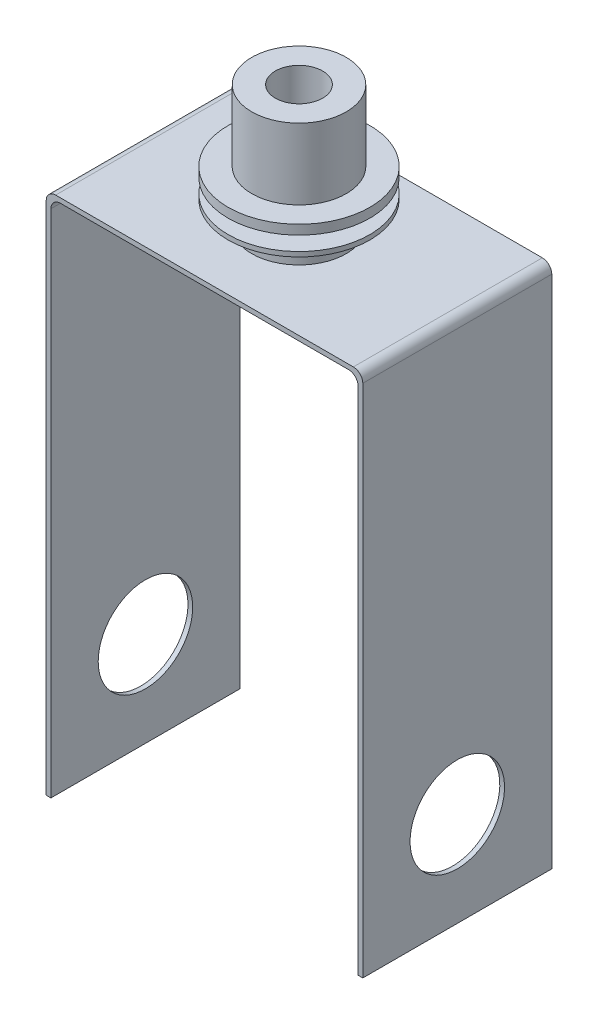
ISO-10303-21;
HEADER;
FILE_DESCRIPTION(('STEP AP214'),'2;1');
FILE_NAME('part.step','',(''),(''),'','','');
FILE_SCHEMA(('AUTOMOTIVE_DESIGN { 1 0 10303 214 1 1 1 1 }'));
ENDSEC;
DATA;
#1=APPLICATION_CONTEXT('core data for automotive mechanical design processes');
#2=APPLICATION_PROTOCOL_DEFINITION('international standard','automotive_design',2000,#1);
#3=PRODUCT_CONTEXT('',#1,'mechanical');
#4=PRODUCT('Part','Part','',(#3));
#5=PRODUCT_RELATED_PRODUCT_CATEGORY('part','',(#4));
#6=PRODUCT_DEFINITION_FORMATION('','',#4);
#7=PRODUCT_DEFINITION_CONTEXT('part definition',#1,'design');
#8=PRODUCT_DEFINITION('design','',#6,#7);
#9=PRODUCT_DEFINITION_SHAPE('','',#8);
#10=(LENGTH_UNIT() NAMED_UNIT(*) SI_UNIT(.MILLI.,.METRE.));
#11=(NAMED_UNIT(*) PLANE_ANGLE_UNIT() SI_UNIT($,.RADIAN.));
#12=(NAMED_UNIT(*) SI_UNIT($,.STERADIAN.) SOLID_ANGLE_UNIT());
#13=UNCERTAINTY_MEASURE_WITH_UNIT(LENGTH_MEASURE(1.E-05),#10,'distance_accuracy_value','');
#14=(GEOMETRIC_REPRESENTATION_CONTEXT(3) GLOBAL_UNCERTAINTY_ASSIGNED_CONTEXT((#13)) GLOBAL_UNIT_ASSIGNED_CONTEXT((#10,
#11,#12)) REPRESENTATION_CONTEXT('',''));
#15=CARTESIAN_POINT('',(0.,0.,0.));
#16=DIRECTION('',(0.,0.,1.));
#17=DIRECTION('',(1.,0.,0.));
#18=AXIS2_PLACEMENT_3D('',#15,#16,#17);
#19=CARTESIAN_POINT('',(0.,148.59,25.4));
#20=DIRECTION('',(0.,-1.,0.));
#21=DIRECTION('',(0.,0.,-1.));
#22=AXIS2_PLACEMENT_3D('',#19,#20,#21);
#23=CYLINDRICAL_SURFACE('',#22,12.7);
#24=CARTESIAN_POINT('',(0.,123.19,25.4));
#25=DIRECTION('',(0.,1.,0.));
#26=DIRECTION('',(0.,0.,1.));
#27=AXIS2_PLACEMENT_3D('',#24,#25,#26);
#28=CIRCLE('',#27,12.7);
#29=CARTESIAN_POINT('',(0.,123.19,38.1));
#30=VERTEX_POINT('',#29);
#31=EDGE_CURVE('E53',#30,#30,#28,.T.);
#32=ORIENTED_EDGE('',*,*,#31,.T.);
#33=EDGE_LOOP('',(#32));
#34=FACE_BOUND('',#33,.T.);
#35=CARTESIAN_POINT('',(0.,127.,25.4));
#36=DIRECTION('',(0.,1.,0.));
#37=DIRECTION('',(0.,0.,1.));
#38=AXIS2_PLACEMENT_3D('',#35,#36,#37);
#39=CIRCLE('',#38,12.7);
#40=CARTESIAN_POINT('',(0.,127.,38.1));
#41=VERTEX_POINT('',#40);
#42=EDGE_CURVE('E11',#41,#41,#39,.T.);
#43=ORIENTED_EDGE('',*,*,#42,.F.);
#44=EDGE_LOOP('',(#43));
#45=FACE_BOUND('',#44,.T.);
#46=ADVANCED_FACE('F43',(#34,#45),#23,.T.);
#47=CARTESIAN_POINT('',(-40.005,113.03,50.8));
#48=DIRECTION('',(0.,0.,-1.));
#49=DIRECTION('',(-1.,0.,0.));
#50=AXIS2_PLACEMENT_3D('',#47,#48,#49);
#51=CYLINDRICAL_SURFACE('',#50,2.54);
#52=CARTESIAN_POINT('',(-40.005,113.03,0.));
#53=DIRECTION('',(0.,0.,-1.));
#54=DIRECTION('',(-1.,0.,0.));
#55=AXIS2_PLACEMENT_3D('',#52,#53,#54);
#56=CIRCLE('',#55,2.54);
#57=CARTESIAN_POINT('',(-42.545,113.03,0.));
#58=VERTEX_POINT('',#57);
#59=CARTESIAN_POINT('',(-40.005,115.57,0.));
#60=VERTEX_POINT('',#59);
#61=EDGE_CURVE('E174',#58,#60,#56,.T.);
#62=ORIENTED_EDGE('',*,*,#61,.F.);
#63=DIRECTION('',(0.,0.,-1.));
#64=VECTOR('',#63,1.);
#65=CARTESIAN_POINT('',(-42.545,113.03,50.8));
#66=LINE('',#65,#64);
#67=CARTESIAN_POINT('',(-42.545,113.03,50.8));
#68=VERTEX_POINT('',#67);
#69=EDGE_CURVE('E61',#68,#58,#66,.T.);
#70=ORIENTED_EDGE('',*,*,#69,.F.);
#71=CARTESIAN_POINT('',(-40.005,113.03,50.8));
#72=DIRECTION('',(0.,0.,-1.));
#73=DIRECTION('',(-1.,0.,0.));
#74=AXIS2_PLACEMENT_3D('',#71,#72,#73);
#75=CIRCLE('',#74,2.54);
#76=CARTESIAN_POINT('',(-40.005,115.57,50.8));
#77=VERTEX_POINT('',#76);
#78=EDGE_CURVE('E216',#68,#77,#75,.T.);
#79=ORIENTED_EDGE('',*,*,#78,.T.);
#80=DIRECTION('',(0.,0.,-1.));
#81=VECTOR('',#80,1.);
#82=CARTESIAN_POINT('',(-40.005,115.57,50.8));
#83=LINE('',#82,#81);
#84=EDGE_CURVE('E111',#77,#60,#83,.T.);
#85=ORIENTED_EDGE('',*,*,#84,.T.);
#86=EDGE_LOOP('',(#62,#70,#79,#85));
#87=FACE_BOUND('',#86,.T.);
#88=ADVANCED_FACE('F45',(#87),#51,.T.);
#89=CARTESIAN_POINT('',(-42.545,113.03,50.8));
#90=DIRECTION('',(1.,0.,0.));
#91=DIRECTION('',(0.,0.,-1.));
#92=AXIS2_PLACEMENT_3D('',#89,#90,#91);
#93=PLANE('',#92);
#94=CARTESIAN_POINT('',(-42.545,0.,25.4));
#95=DIRECTION('',(-1.,0.,0.));
#96=DIRECTION('',(0.,0.,1.));
#97=AXIS2_PLACEMENT_3D('',#94,#95,#96);
#98=CIRCLE('',#97,12.7);
#99=CARTESIAN_POINT('',(-42.545,0.,38.1));
#100=VERTEX_POINT('',#99);
#101=EDGE_CURVE('E293',#100,#100,#98,.T.);
#102=ORIENTED_EDGE('',*,*,#101,.F.);
#103=EDGE_LOOP('',(#102));
#104=FACE_BOUND('',#103,.T.);
#105=DIRECTION('',(0.,-1.,0.));
#106=VECTOR('',#105,1.);
#107=CARTESIAN_POINT('',(-42.545,113.03,0.));
#108=LINE('',#107,#106);
#109=CARTESIAN_POINT('',(-42.545,-25.4,0.));
#110=VERTEX_POINT('',#109);
#111=EDGE_CURVE('E102',#58,#110,#108,.T.);
#112=ORIENTED_EDGE('',*,*,#111,.T.);
#113=DIRECTION('',(0.,0.,-1.));
#114=VECTOR('',#113,1.);
#115=CARTESIAN_POINT('',(-42.545,-25.4,50.8));
#116=LINE('',#115,#114);
#117=CARTESIAN_POINT('',(-42.545,-25.4,50.8));
#118=VERTEX_POINT('',#117);
#119=EDGE_CURVE('E159',#118,#110,#116,.T.);
#120=ORIENTED_EDGE('',*,*,#119,.F.);
#121=DIRECTION('',(0.,-1.,0.));
#122=VECTOR('',#121,1.);
#123=CARTESIAN_POINT('',(-42.545,113.03,50.8));
#124=LINE('',#123,#122);
#125=EDGE_CURVE('E146',#68,#118,#124,.T.);
#126=ORIENTED_EDGE('',*,*,#125,.F.);
#127=ORIENTED_EDGE('',*,*,#69,.T.);
#128=EDGE_LOOP('',(#112,#120,#126,#127));
#129=FACE_BOUND('',#128,.T.);
#130=ADVANCED_FACE('F369',(#104,#129),#93,.F.);
#131=CARTESIAN_POINT('',(-42.545,-25.4,50.8));
#132=DIRECTION('',(0.,1.,0.));
#133=DIRECTION('',(-1.,0.,0.));
#134=AXIS2_PLACEMENT_3D('',#131,#132,#133);
#135=PLANE('',#134);
#136=DIRECTION('',(1.,0.,0.));
#137=VECTOR('',#136,1.);
#138=CARTESIAN_POINT('',(-42.545,-25.4,0.));
#139=LINE('',#138,#137);
#140=CARTESIAN_POINT('',(-41.275,-25.4,0.));
#141=VERTEX_POINT('',#140);
#142=EDGE_CURVE('E154',#110,#141,#139,.T.);
#143=ORIENTED_EDGE('',*,*,#142,.T.);
#144=DIRECTION('',(0.,0.,-1.));
#145=VECTOR('',#144,1.);
#146=CARTESIAN_POINT('',(-41.275,-25.4,50.8));
#147=LINE('',#146,#145);
#148=CARTESIAN_POINT('',(-41.275,-25.4,50.8));
#149=VERTEX_POINT('',#148);
#150=EDGE_CURVE('E151',#149,#141,#147,.T.);
#151=ORIENTED_EDGE('',*,*,#150,.F.);
#152=DIRECTION('',(1.,0.,0.));
#153=VECTOR('',#152,1.);
#154=CARTESIAN_POINT('',(-42.545,-25.4,50.8));
#155=LINE('',#154,#153);
#156=EDGE_CURVE('E140',#118,#149,#155,.T.);
#157=ORIENTED_EDGE('',*,*,#156,.F.);
#158=ORIENTED_EDGE('',*,*,#119,.T.);
#159=EDGE_LOOP('',(#143,#151,#157,#158));
#160=FACE_BOUND('',#159,.T.);
#161=ADVANCED_FACE('F152',(#160),#135,.F.);
#162=CARTESIAN_POINT('',(-41.275,111.76,50.8));
#163=DIRECTION('',(1.,0.,0.));
#164=DIRECTION('',(0.,1.,0.));
#165=AXIS2_PLACEMENT_3D('',#162,#163,#164);
#166=PLANE('',#165);
#167=CARTESIAN_POINT('',(-41.275,0.,25.4));
#168=DIRECTION('',(1.,0.,0.));
#169=DIRECTION('',(0.,1.,0.));
#170=AXIS2_PLACEMENT_3D('',#167,#168,#169);
#171=CIRCLE('',#170,12.7);
#172=CARTESIAN_POINT('',(-41.275,12.7,25.4));
#173=VERTEX_POINT('',#172);
#174=EDGE_CURVE('E179',#173,#173,#171,.T.);
#175=ORIENTED_EDGE('',*,*,#174,.F.);
#176=EDGE_LOOP('',(#175));
#177=FACE_BOUND('',#176,.T.);
#178=DIRECTION('',(0.,-1.,0.));
#179=VECTOR('',#178,1.);
#180=CARTESIAN_POINT('',(-41.275,111.76,0.));
#181=LINE('',#180,#179);
#182=CARTESIAN_POINT('',(-41.275,111.76,0.));
#183=VERTEX_POINT('',#182);
#184=EDGE_CURVE('E209',#183,#141,#181,.T.);
#185=ORIENTED_EDGE('',*,*,#184,.F.);
#186=DIRECTION('',(0.,0.,-1.));
#187=VECTOR('',#186,1.);
#188=CARTESIAN_POINT('',(-41.275,111.76,50.8));
#189=LINE('',#188,#187);
#190=CARTESIAN_POINT('',(-41.275,111.76,50.8));
#191=VERTEX_POINT('',#190);
#192=EDGE_CURVE('E160',#191,#183,#189,.T.);
#193=ORIENTED_EDGE('',*,*,#192,.F.);
#194=DIRECTION('',(0.,-1.,0.));
#195=VECTOR('',#194,1.);
#196=CARTESIAN_POINT('',(-41.275,111.76,50.8));
#197=LINE('',#196,#195);
#198=EDGE_CURVE('E145',#191,#149,#197,.T.);
#199=ORIENTED_EDGE('',*,*,#198,.T.);
#200=ORIENTED_EDGE('',*,*,#150,.T.);
#201=EDGE_LOOP('',(#185,#193,#199,#200));
#202=FACE_BOUND('',#201,.T.);
#203=ADVANCED_FACE('F162',(#177,#202),#166,.T.);
#204=CARTESIAN_POINT('',(-38.735,111.76,50.8));
#205=DIRECTION('',(0.,0.,-1.));
#206=DIRECTION('',(-1.,0.,0.));
#207=AXIS2_PLACEMENT_3D('',#204,#205,#206);
#208=CYLINDRICAL_SURFACE('',#207,2.54);
#209=CARTESIAN_POINT('',(-38.735,111.76,0.));
#210=DIRECTION('',(0.,0.,-1.));
#211=DIRECTION('',(-1.,0.,0.));
#212=AXIS2_PLACEMENT_3D('',#209,#210,#211);
#213=CIRCLE('',#212,2.54);
#214=CARTESIAN_POINT('',(-38.735,114.3,0.));
#215=VERTEX_POINT('',#214);
#216=EDGE_CURVE('E206',#183,#215,#213,.T.);
#217=ORIENTED_EDGE('',*,*,#216,.T.);
#218=DIRECTION('',(0.,0.,-1.));
#219=VECTOR('',#218,1.);
#220=CARTESIAN_POINT('',(-38.735,114.3,50.8));
#221=LINE('',#220,#219);
#222=CARTESIAN_POINT('',(-38.735,114.3,50.8));
#223=VERTEX_POINT('',#222);
#224=EDGE_CURVE('E223',#223,#215,#221,.T.);
#225=ORIENTED_EDGE('',*,*,#224,.F.);
#226=CARTESIAN_POINT('',(-38.735,111.76,50.8));
#227=DIRECTION('',(0.,0.,-1.));
#228=DIRECTION('',(-1.,0.,0.));
#229=AXIS2_PLACEMENT_3D('',#226,#227,#228);
#230=CIRCLE('',#229,2.54);
#231=EDGE_CURVE('E165',#191,#223,#230,.T.);
#232=ORIENTED_EDGE('',*,*,#231,.F.);
#233=ORIENTED_EDGE('',*,*,#192,.T.);
#234=EDGE_LOOP('',(#217,#225,#232,#233));
#235=FACE_BOUND('',#234,.T.);
#236=ADVANCED_FACE('F255',(#235),#208,.F.);
#237=CARTESIAN_POINT('',(-38.735,114.3,50.8));
#238=DIRECTION('',(0.,1.,0.));
#239=DIRECTION('',(0.,0.,1.));
#240=AXIS2_PLACEMENT_3D('',#237,#238,#239);
#241=PLANE('',#240);
#242=CARTESIAN_POINT('',(0.,114.3,25.4));
#243=DIRECTION('',(0.,1.,0.));
#244=DIRECTION('',(0.,0.,1.));
#245=AXIS2_PLACEMENT_3D('',#242,#243,#244);
#246=CIRCLE('',#245,6.35);
#247=CARTESIAN_POINT('',(0.,114.3,31.75));
#248=VERTEX_POINT('',#247);
#249=EDGE_CURVE('E323',#248,#248,#246,.T.);
#250=ORIENTED_EDGE('',*,*,#249,.T.);
#251=EDGE_LOOP('',(#250));
#252=FACE_BOUND('',#251,.T.);
#253=DIRECTION('',(1.,0.,0.));
#254=VECTOR('',#253,1.);
#255=CARTESIAN_POINT('',(-38.735,114.3,0.));
#256=LINE('',#255,#254);
#257=CARTESIAN_POINT('',(38.735,114.3,0.));
#258=VERTEX_POINT('',#257);
#259=EDGE_CURVE('E202',#215,#258,#256,.T.);
#260=ORIENTED_EDGE('',*,*,#259,.T.);
#261=DIRECTION('',(0.,0.,-1.));
#262=VECTOR('',#261,1.);
#263=CARTESIAN_POINT('',(38.735,114.3,50.8));
#264=LINE('',#263,#262);
#265=CARTESIAN_POINT('',(38.735,114.3,50.8));
#266=VERTEX_POINT('',#265);
#267=EDGE_CURVE('E227',#266,#258,#264,.T.);
#268=ORIENTED_EDGE('',*,*,#267,.F.);
#269=DIRECTION('',(1.,0.,0.));
#270=VECTOR('',#269,1.);
#271=CARTESIAN_POINT('',(-38.735,114.3,50.8));
#272=LINE('',#271,#270);
#273=EDGE_CURVE('E168',#223,#266,#272,.T.);
#274=ORIENTED_EDGE('',*,*,#273,.F.);
#275=ORIENTED_EDGE('',*,*,#224,.T.);
#276=EDGE_LOOP('',(#260,#268,#274,#275));
#277=FACE_BOUND('',#276,.T.);
#278=ADVANCED_FACE('F258',(#252,#277),#241,.F.);
#279=CARTESIAN_POINT('',(38.735,111.76,50.8));
#280=DIRECTION('',(0.,0.,-1.));
#281=DIRECTION('',(-1.,0.,0.));
#282=AXIS2_PLACEMENT_3D('',#279,#280,#281);
#283=CYLINDRICAL_SURFACE('',#282,2.54);
#284=CARTESIAN_POINT('',(38.735,111.76,0.));
#285=DIRECTION('',(0.,0.,1.));
#286=DIRECTION('',(1.,0.,0.));
#287=AXIS2_PLACEMENT_3D('',#284,#285,#286);
#288=CIRCLE('',#287,2.54);
#289=CARTESIAN_POINT('',(41.275,111.76,0.));
#290=VERTEX_POINT('',#289);
#291=EDGE_CURVE('E198',#290,#258,#288,.T.);
#292=ORIENTED_EDGE('',*,*,#291,.F.);
#293=DIRECTION('',(0.,0.,-1.));
#294=VECTOR('',#293,1.);
#295=CARTESIAN_POINT('',(41.275,111.76,50.8));
#296=LINE('',#295,#294);
#297=CARTESIAN_POINT('',(41.275,111.76,50.8));
#298=VERTEX_POINT('',#297);
#299=EDGE_CURVE('E230',#298,#290,#296,.T.);
#300=ORIENTED_EDGE('',*,*,#299,.F.);
#301=CARTESIAN_POINT('',(38.735,111.76,50.8));
#302=DIRECTION('',(0.,0.,1.));
#303=DIRECTION('',(1.,0.,0.));
#304=AXIS2_PLACEMENT_3D('',#301,#302,#303);
#305=CIRCLE('',#304,2.54);
#306=EDGE_CURVE('E263',#298,#266,#305,.T.);
#307=ORIENTED_EDGE('',*,*,#306,.T.);
#308=ORIENTED_EDGE('',*,*,#267,.T.);
#309=EDGE_LOOP('',(#292,#300,#307,#308));
#310=FACE_BOUND('',#309,.T.);
#311=ADVANCED_FACE('F418',(#310),#283,.F.);
#312=CARTESIAN_POINT('',(41.275,111.76,50.8));
#313=DIRECTION('',(1.,0.,0.));
#314=DIRECTION('',(0.,1.,0.));
#315=AXIS2_PLACEMENT_3D('',#312,#313,#314);
#316=PLANE('',#315);
#317=CARTESIAN_POINT('',(41.275,0.,25.4));
#318=DIRECTION('',(1.,0.,0.));
#319=DIRECTION('',(0.,1.,0.));
#320=AXIS2_PLACEMENT_3D('',#317,#318,#319);
#321=CIRCLE('',#320,12.7);
#322=CARTESIAN_POINT('',(41.275,12.7,25.4));
#323=VERTEX_POINT('',#322);
#324=EDGE_CURVE('E288',#323,#323,#321,.T.);
#325=ORIENTED_EDGE('',*,*,#324,.T.);
#326=EDGE_LOOP('',(#325));
#327=FACE_BOUND('',#326,.T.);
#328=DIRECTION('',(0.,-1.,0.));
#329=VECTOR('',#328,1.);
#330=CARTESIAN_POINT('',(41.275,111.76,0.));
#331=LINE('',#330,#329);
#332=CARTESIAN_POINT('',(41.275,-25.4,0.));
#333=VERTEX_POINT('',#332);
#334=EDGE_CURVE('E195',#290,#333,#331,.T.);
#335=ORIENTED_EDGE('',*,*,#334,.T.);
#336=DIRECTION('',(0.,0.,-1.));
#337=VECTOR('',#336,1.);
#338=CARTESIAN_POINT('',(41.275,-25.4,50.8));
#339=LINE('',#338,#337);
#340=CARTESIAN_POINT('',(41.275,-25.4,50.8));
#341=VERTEX_POINT('',#340);
#342=EDGE_CURVE('E233',#341,#333,#339,.T.);
#343=ORIENTED_EDGE('',*,*,#342,.F.);
#344=DIRECTION('',(0.,-1.,0.));
#345=VECTOR('',#344,1.);
#346=CARTESIAN_POINT('',(41.275,111.76,50.8));
#347=LINE('',#346,#345);
#348=EDGE_CURVE('E265',#298,#341,#347,.T.);
#349=ORIENTED_EDGE('',*,*,#348,.F.);
#350=ORIENTED_EDGE('',*,*,#299,.T.);
#351=EDGE_LOOP('',(#335,#343,#349,#350));
#352=FACE_BOUND('',#351,.T.);
#353=ADVANCED_FACE('F422',(#327,#352),#316,.F.);
#354=CARTESIAN_POINT('',(41.275,-25.4,50.8));
#355=DIRECTION('',(0.,1.,0.));
#356=DIRECTION('',(-1.,0.,0.));
#357=AXIS2_PLACEMENT_3D('',#354,#355,#356);
#358=PLANE('',#357);
#359=DIRECTION('',(1.,0.,0.));
#360=VECTOR('',#359,1.);
#361=CARTESIAN_POINT('',(41.275,-25.4,0.));
#362=LINE('',#361,#360);
#363=CARTESIAN_POINT('',(42.545,-25.4,0.));
#364=VERTEX_POINT('',#363);
#365=EDGE_CURVE('E191',#333,#364,#362,.T.);
#366=ORIENTED_EDGE('',*,*,#365,.T.);
#367=DIRECTION('',(0.,0.,-1.));
#368=VECTOR('',#367,1.);
#369=CARTESIAN_POINT('',(42.545,-25.4,50.8));
#370=LINE('',#369,#368);
#371=CARTESIAN_POINT('',(42.545,-25.4,50.8));
#372=VERTEX_POINT('',#371);
#373=EDGE_CURVE('E237',#372,#364,#370,.T.);
#374=ORIENTED_EDGE('',*,*,#373,.F.);
#375=DIRECTION('',(1.,0.,0.));
#376=VECTOR('',#375,1.);
#377=CARTESIAN_POINT('',(41.275,-25.4,50.8));
#378=LINE('',#377,#376);
#379=EDGE_CURVE('E270',#341,#372,#378,.T.);
#380=ORIENTED_EDGE('',*,*,#379,.F.);
#381=ORIENTED_EDGE('',*,*,#342,.T.);
#382=EDGE_LOOP('',(#366,#374,#380,#381));
#383=FACE_BOUND('',#382,.T.);
#384=ADVANCED_FACE('F426',(#383),#358,.F.);
#385=CARTESIAN_POINT('',(42.545,113.03,50.8));
#386=DIRECTION('',(1.,0.,0.));
#387=DIRECTION('',(0.,1.,0.));
#388=AXIS2_PLACEMENT_3D('',#385,#386,#387);
#389=PLANE('',#388);
#390=CARTESIAN_POINT('',(42.545,0.,25.4));
#391=DIRECTION('',(-1.,0.,0.));
#392=DIRECTION('',(0.,0.,1.));
#393=AXIS2_PLACEMENT_3D('',#390,#391,#392);
#394=CIRCLE('',#393,12.7);
#395=CARTESIAN_POINT('',(42.545,0.,38.1));
#396=VERTEX_POINT('',#395);
#397=EDGE_CURVE('E292',#396,#396,#394,.T.);
#398=ORIENTED_EDGE('',*,*,#397,.T.);
#399=EDGE_LOOP('',(#398));
#400=FACE_BOUND('',#399,.T.);
#401=DIRECTION('',(0.,-1.,0.));
#402=VECTOR('',#401,1.);
#403=CARTESIAN_POINT('',(42.545,113.03,0.));
#404=LINE('',#403,#402);
#405=CARTESIAN_POINT('',(42.545,113.03,0.));
#406=VERTEX_POINT('',#405);
#407=EDGE_CURVE('E187',#406,#364,#404,.T.);
#408=ORIENTED_EDGE('',*,*,#407,.F.);
#409=DIRECTION('',(0.,0.,-1.));
#410=VECTOR('',#409,1.);
#411=CARTESIAN_POINT('',(42.545,113.03,50.8));
#412=LINE('',#411,#410);
#413=CARTESIAN_POINT('',(42.545,113.03,50.8));
#414=VERTEX_POINT('',#413);
#415=EDGE_CURVE('E240',#414,#406,#412,.T.);
#416=ORIENTED_EDGE('',*,*,#415,.F.);
#417=DIRECTION('',(0.,-1.,0.));
#418=VECTOR('',#417,1.);
#419=CARTESIAN_POINT('',(42.545,113.03,50.8));
#420=LINE('',#419,#418);
#421=EDGE_CURVE('E273',#414,#372,#420,.T.);
#422=ORIENTED_EDGE('',*,*,#421,.T.);
#423=ORIENTED_EDGE('',*,*,#373,.T.);
#424=EDGE_LOOP('',(#408,#416,#422,#423));
#425=FACE_BOUND('',#424,.T.);
#426=ADVANCED_FACE('F430',(#400,#425),#389,.T.);
#427=CARTESIAN_POINT('',(40.005,113.03,50.8));
#428=DIRECTION('',(0.,0.,-1.));
#429=DIRECTION('',(-1.,0.,0.));
#430=AXIS2_PLACEMENT_3D('',#427,#428,#429);
#431=CYLINDRICAL_SURFACE('',#430,2.54);
#432=CARTESIAN_POINT('',(40.005,113.03,0.));
#433=DIRECTION('',(0.,0.,1.));
#434=DIRECTION('',(1.,0.,0.));
#435=AXIS2_PLACEMENT_3D('',#432,#433,#434);
#436=CIRCLE('',#435,2.54);
#437=CARTESIAN_POINT('',(40.005,115.57,0.));
#438=VERTEX_POINT('',#437);
#439=EDGE_CURVE('E183',#406,#438,#436,.T.);
#440=ORIENTED_EDGE('',*,*,#439,.T.);
#441=DIRECTION('',(0.,0.,-1.));
#442=VECTOR('',#441,1.);
#443=CARTESIAN_POINT('',(40.005,115.57,50.8));
#444=LINE('',#443,#442);
#445=CARTESIAN_POINT('',(40.005,115.57,50.8));
#446=VERTEX_POINT('',#445);
#447=EDGE_CURVE('E243',#446,#438,#444,.T.);
#448=ORIENTED_EDGE('',*,*,#447,.F.);
#449=CARTESIAN_POINT('',(40.005,113.03,50.8));
#450=DIRECTION('',(0.,0.,1.));
#451=DIRECTION('',(1.,0.,0.));
#452=AXIS2_PLACEMENT_3D('',#449,#450,#451);
#453=CIRCLE('',#452,2.54);
#454=EDGE_CURVE('E277',#414,#446,#453,.T.);
#455=ORIENTED_EDGE('',*,*,#454,.F.);
#456=ORIENTED_EDGE('',*,*,#415,.T.);
#457=EDGE_LOOP('',(#440,#448,#455,#456));
#458=FACE_BOUND('',#457,.T.);
#459=ADVANCED_FACE('F434',(#458),#431,.T.);
#460=CARTESIAN_POINT('',(-40.005,115.57,50.8));
#461=DIRECTION('',(0.,1.,0.));
#462=DIRECTION('',(0.,0.,1.));
#463=AXIS2_PLACEMENT_3D('',#460,#461,#462);
#464=PLANE('',#463);
#465=CARTESIAN_POINT('',(0.,115.57,25.4));
#466=DIRECTION('',(0.,1.,0.));
#467=DIRECTION('',(0.,0.,1.));
#468=AXIS2_PLACEMENT_3D('',#465,#466,#467);
#469=CIRCLE('',#468,12.7);
#470=CARTESIAN_POINT('',(0.,115.57,38.1));
#471=VERTEX_POINT('',#470);
#472=EDGE_CURVE('E301',#471,#471,#469,.T.);
#473=ORIENTED_EDGE('',*,*,#472,.F.);
#474=EDGE_LOOP('',(#473));
#475=FACE_BOUND('',#474,.T.);
#476=DIRECTION('',(1.,0.,0.));
#477=VECTOR('',#476,1.);
#478=CARTESIAN_POINT('',(-40.005,115.57,0.));
#479=LINE('',#478,#477);
#480=EDGE_CURVE('E178',#60,#438,#479,.T.);
#481=ORIENTED_EDGE('',*,*,#480,.F.);
#482=ORIENTED_EDGE('',*,*,#84,.F.);
#483=DIRECTION('',(1.,0.,0.));
#484=VECTOR('',#483,1.);
#485=CARTESIAN_POINT('',(-40.005,115.57,50.8));
#486=LINE('',#485,#484);
#487=EDGE_CURVE('E280',#77,#446,#486,.T.);
#488=ORIENTED_EDGE('',*,*,#487,.T.);
#489=ORIENTED_EDGE('',*,*,#447,.T.);
#490=EDGE_LOOP('',(#481,#482,#488,#489));
#491=FACE_BOUND('',#490,.T.);
#492=ADVANCED_FACE('F246',(#475,#491),#464,.T.);
#493=CARTESIAN_POINT('',(-40.005,113.03,50.8));
#494=DIRECTION('',(0.,0.,-1.));
#495=DIRECTION('',(-1.,0.,0.));
#496=AXIS2_PLACEMENT_3D('',#493,#494,#495);
#497=PLANE('',#496);
#498=ORIENTED_EDGE('',*,*,#78,.F.);
#499=ORIENTED_EDGE('',*,*,#125,.T.);
#500=ORIENTED_EDGE('',*,*,#156,.T.);
#501=ORIENTED_EDGE('',*,*,#198,.F.);
#502=ORIENTED_EDGE('',*,*,#231,.T.);
#503=ORIENTED_EDGE('',*,*,#273,.T.);
#504=ORIENTED_EDGE('',*,*,#306,.F.);
#505=ORIENTED_EDGE('',*,*,#348,.T.);
#506=ORIENTED_EDGE('',*,*,#379,.T.);
#507=ORIENTED_EDGE('',*,*,#421,.F.);
#508=ORIENTED_EDGE('',*,*,#454,.T.);
#509=ORIENTED_EDGE('',*,*,#487,.F.);
#510=EDGE_LOOP('',(#498,#499,#500,#501,#502,#503,#504,#505,#506,#507,#508,#509));
#511=FACE_BOUND('',#510,.T.);
#512=ADVANCED_FACE('F143',(#511),#497,.F.);
#513=CARTESIAN_POINT('',(-40.005,113.03,0.));
#514=DIRECTION('',(0.,0.,-1.));
#515=DIRECTION('',(-1.,0.,0.));
#516=AXIS2_PLACEMENT_3D('',#513,#514,#515);
#517=PLANE('',#516);
#518=ORIENTED_EDGE('',*,*,#61,.T.);
#519=ORIENTED_EDGE('',*,*,#480,.T.);
#520=ORIENTED_EDGE('',*,*,#439,.F.);
#521=ORIENTED_EDGE('',*,*,#407,.T.);
#522=ORIENTED_EDGE('',*,*,#365,.F.);
#523=ORIENTED_EDGE('',*,*,#334,.F.);
#524=ORIENTED_EDGE('',*,*,#291,.T.);
#525=ORIENTED_EDGE('',*,*,#259,.F.);
#526=ORIENTED_EDGE('',*,*,#216,.F.);
#527=ORIENTED_EDGE('',*,*,#184,.T.);
#528=ORIENTED_EDGE('',*,*,#142,.F.);
#529=ORIENTED_EDGE('',*,*,#111,.F.);
#530=EDGE_LOOP('',(#518,#519,#520,#521,#522,#523,#524,#525,#526,#527,#528,#529));
#531=FACE_BOUND('',#530,.T.);
#532=ADVANCED_FACE('F250',(#531),#517,.T.);
#533=CARTESIAN_POINT('',(42.545,0.,25.4));
#534=DIRECTION('',(-1.,0.,0.));
#535=DIRECTION('',(0.,0.,1.));
#536=AXIS2_PLACEMENT_3D('',#533,#534,#535);
#537=CYLINDRICAL_SURFACE('',#536,12.7);
#538=ORIENTED_EDGE('',*,*,#397,.F.);
#539=EDGE_LOOP('',(#538));
#540=FACE_BOUND('',#539,.T.);
#541=ORIENTED_EDGE('',*,*,#324,.F.);
#542=EDGE_LOOP('',(#541));
#543=FACE_BOUND('',#542,.T.);
#544=ADVANCED_FACE('F400',(#540,#543),#537,.F.);
#545=ORIENTED_EDGE('',*,*,#174,.T.);
#546=EDGE_LOOP('',(#545));
#547=FACE_BOUND('',#546,.T.);
#548=ORIENTED_EDGE('',*,*,#101,.T.);
#549=EDGE_LOOP('',(#548));
#550=FACE_BOUND('',#549,.T.);
#551=ADVANCED_FACE('F396',(#547,#550),#537,.F.);
#552=CARTESIAN_POINT('',(0.,121.92,25.4));
#553=DIRECTION('',(0.,-1.,0.));
#554=DIRECTION('',(0.,0.,-1.));
#555=AXIS2_PLACEMENT_3D('',#552,#553,#554);
#556=CYLINDRICAL_SURFACE('',#555,12.7);
#557=CARTESIAN_POINT('',(0.,121.92,25.4));
#558=DIRECTION('',(0.,1.,0.));
#559=DIRECTION('',(0.,0.,1.));
#560=AXIS2_PLACEMENT_3D('',#557,#558,#559);
#561=CIRCLE('',#560,12.7);
#562=CARTESIAN_POINT('',(0.,121.92,38.1));
#563=VERTEX_POINT('',#562);
#564=EDGE_CURVE('E297',#563,#563,#561,.T.);
#565=ORIENTED_EDGE('',*,*,#564,.F.);
#566=EDGE_LOOP('',(#565));
#567=FACE_BOUND('',#566,.T.);
#568=ORIENTED_EDGE('',*,*,#472,.T.);
#569=EDGE_LOOP('',(#568));
#570=FACE_BOUND('',#569,.T.);
#571=ADVANCED_FACE('F392',(#567,#570),#556,.T.);
#572=CARTESIAN_POINT('',(0.,123.19,25.4));
#573=DIRECTION('',(0.,-1.,0.));
#574=DIRECTION('',(0.,0.,-1.));
#575=AXIS2_PLACEMENT_3D('',#572,#573,#574);
#576=CYLINDRICAL_SURFACE('',#575,19.05);
#577=CARTESIAN_POINT('',(0.,123.19,25.4));
#578=DIRECTION('',(0.,1.,0.));
#579=DIRECTION('',(0.,0.,1.));
#580=AXIS2_PLACEMENT_3D('',#577,#578,#579);
#581=CIRCLE('',#580,19.05);
#582=CARTESIAN_POINT('',(0.,123.19,44.45));
#583=VERTEX_POINT('',#582);
#584=EDGE_CURVE('E305',#583,#583,#581,.T.);
#585=ORIENTED_EDGE('',*,*,#584,.F.);
#586=EDGE_LOOP('',(#585));
#587=FACE_BOUND('',#586,.T.);
#588=CARTESIAN_POINT('',(0.,121.92,25.4));
#589=DIRECTION('',(0.,1.,0.));
#590=DIRECTION('',(0.,0.,1.));
#591=AXIS2_PLACEMENT_3D('',#588,#589,#590);
#592=CIRCLE('',#591,19.05);
#593=CARTESIAN_POINT('',(0.,121.92,44.45));
#594=VERTEX_POINT('',#593);
#595=EDGE_CURVE('E309',#594,#594,#592,.T.);
#596=ORIENTED_EDGE('',*,*,#595,.T.);
#597=EDGE_LOOP('',(#596));
#598=FACE_BOUND('',#597,.T.);
#599=ADVANCED_FACE('F386',(#587,#598),#576,.T.);
#600=CARTESIAN_POINT('',(0.,123.19,25.4));
#601=DIRECTION('',(0.,1.,0.));
#602=DIRECTION('',(0.,0.,1.));
#603=AXIS2_PLACEMENT_3D('',#600,#601,#602);
#604=PLANE('',#603);
#605=ORIENTED_EDGE('',*,*,#31,.F.);
#606=EDGE_LOOP('',(#605));
#607=FACE_BOUND('',#606,.T.);
#608=ORIENTED_EDGE('',*,*,#584,.T.);
#609=EDGE_LOOP('',(#608));
#610=FACE_BOUND('',#609,.T.);
#611=ADVANCED_FACE('F380',(#607,#610),#604,.T.);
#612=CARTESIAN_POINT('',(0.,121.92,25.4));
#613=DIRECTION('',(0.,1.,0.));
#614=DIRECTION('',(0.,0.,1.));
#615=AXIS2_PLACEMENT_3D('',#612,#613,#614);
#616=PLANE('',#615);
#617=ORIENTED_EDGE('',*,*,#564,.T.);
#618=EDGE_LOOP('',(#617));
#619=FACE_BOUND('',#618,.T.);
#620=ORIENTED_EDGE('',*,*,#595,.F.);
#621=EDGE_LOOP('',(#620));
#622=FACE_BOUND('',#621,.T.);
#623=ADVANCED_FACE('F374',(#619,#622),#616,.F.);
#624=CARTESIAN_POINT('',(0.,129.54,25.4));
#625=DIRECTION('',(0.,1.,0.));
#626=DIRECTION('',(0.,0.,1.));
#627=AXIS2_PLACEMENT_3D('',#624,#625,#626);
#628=CIRCLE('',#627,12.7);
#629=CARTESIAN_POINT('',(0.,129.54,38.1));
#630=VERTEX_POINT('',#629);
#631=EDGE_CURVE('E336',#630,#630,#628,.T.);
#632=ORIENTED_EDGE('',*,*,#631,.T.);
#633=EDGE_LOOP('',(#632));
#634=FACE_BOUND('',#633,.T.);
#635=CARTESIAN_POINT('',(0.,148.59,25.4));
#636=DIRECTION('',(0.,1.,0.));
#637=DIRECTION('',(0.,0.,1.));
#638=AXIS2_PLACEMENT_3D('',#635,#636,#637);
#639=CIRCLE('',#638,12.7);
#640=CARTESIAN_POINT('',(0.,148.59,38.1));
#641=VERTEX_POINT('',#640);
#642=EDGE_CURVE('E313',#641,#641,#639,.T.);
#643=ORIENTED_EDGE('',*,*,#642,.F.);
#644=EDGE_LOOP('',(#643));
#645=FACE_BOUND('',#644,.T.);
#646=ADVANCED_FACE('F344',(#634,#645),#23,.T.);
#647=CARTESIAN_POINT('',(0.,148.59,25.4));
#648=DIRECTION('',(0.,1.,0.));
#649=DIRECTION('',(0.,0.,1.));
#650=AXIS2_PLACEMENT_3D('',#647,#648,#649);
#651=PLANE('',#650);
#652=CARTESIAN_POINT('',(0.,148.59,25.4));
#653=DIRECTION('',(0.,1.,0.));
#654=DIRECTION('',(0.,0.,1.));
#655=AXIS2_PLACEMENT_3D('',#652,#653,#654);
#656=CIRCLE('',#655,6.35);
#657=CARTESIAN_POINT('',(0.,148.59,31.75));
#658=VERTEX_POINT('',#657);
#659=EDGE_CURVE('E327',#658,#658,#656,.T.);
#660=ORIENTED_EDGE('',*,*,#659,.F.);
#661=EDGE_LOOP('',(#660));
#662=FACE_BOUND('',#661,.T.);
#663=ORIENTED_EDGE('',*,*,#642,.T.);
#664=EDGE_LOOP('',(#663));
#665=FACE_BOUND('',#664,.T.);
#666=ADVANCED_FACE('F360',(#662,#665),#651,.T.);
#667=CARTESIAN_POINT('',(0.,-25.4,25.4));
#668=DIRECTION('',(0.,1.,0.));
#669=DIRECTION('',(0.,0.,1.));
#670=AXIS2_PLACEMENT_3D('',#667,#668,#669);
#671=CYLINDRICAL_SURFACE('',#670,6.35);
#672=ORIENTED_EDGE('',*,*,#659,.T.);
#673=EDGE_LOOP('',(#672));
#674=FACE_BOUND('',#673,.T.);
#675=ORIENTED_EDGE('',*,*,#249,.F.);
#676=EDGE_LOOP('',(#675));
#677=FACE_BOUND('',#676,.T.);
#678=ADVANCED_FACE('F350',(#674,#677),#671,.F.);
#679=CARTESIAN_POINT('',(0.,129.54,25.4));
#680=DIRECTION('',(0.,1.,0.));
#681=DIRECTION('',(0.,0.,1.));
#682=AXIS2_PLACEMENT_3D('',#679,#680,#681);
#683=PLANE('',#682);
#684=CARTESIAN_POINT('',(0.,129.54,25.4));
#685=DIRECTION('',(0.,1.,0.));
#686=DIRECTION('',(0.,0.,1.));
#687=AXIS2_PLACEMENT_3D('',#684,#685,#686);
#688=CIRCLE('',#687,19.05);
#689=CARTESIAN_POINT('',(0.,129.54,44.45));
#690=VERTEX_POINT('',#689);
#691=EDGE_CURVE('E331',#690,#690,#688,.T.);
#692=ORIENTED_EDGE('',*,*,#691,.T.);
#693=EDGE_LOOP('',(#692));
#694=FACE_BOUND('',#693,.T.);
#695=ORIENTED_EDGE('',*,*,#631,.F.);
#696=EDGE_LOOP('',(#695));
#697=FACE_BOUND('',#696,.T.);
#698=ADVANCED_FACE('F347',(#694,#697),#683,.T.);
#699=CARTESIAN_POINT('',(0.,127.,25.4));
#700=DIRECTION('',(0.,1.,0.));
#701=DIRECTION('',(0.,0.,1.));
#702=AXIS2_PLACEMENT_3D('',#699,#700,#701);
#703=PLANE('',#702);
#704=CARTESIAN_POINT('',(0.,127.,25.4));
#705=DIRECTION('',(0.,1.,0.));
#706=DIRECTION('',(0.,0.,1.));
#707=AXIS2_PLACEMENT_3D('',#704,#705,#706);
#708=CIRCLE('',#707,19.05);
#709=CARTESIAN_POINT('',(0.,127.,44.45));
#710=VERTEX_POINT('',#709);
#711=EDGE_CURVE('E332',#710,#710,#708,.T.);
#712=ORIENTED_EDGE('',*,*,#711,.F.);
#713=EDGE_LOOP('',(#712));
#714=FACE_BOUND('',#713,.T.);
#715=ORIENTED_EDGE('',*,*,#42,.T.);
#716=EDGE_LOOP('',(#715));
#717=FACE_BOUND('',#716,.T.);
#718=ADVANCED_FACE('F349',(#714,#717),#703,.F.);
#719=CARTESIAN_POINT('',(0.,129.54,25.4));
#720=DIRECTION('',(0.,-1.,0.));
#721=DIRECTION('',(0.,0.,-1.));
#722=AXIS2_PLACEMENT_3D('',#719,#720,#721);
#723=CYLINDRICAL_SURFACE('',#722,19.05);
#724=ORIENTED_EDGE('',*,*,#691,.F.);
#725=EDGE_LOOP('',(#724));
#726=FACE_BOUND('',#725,.T.);
#727=ORIENTED_EDGE('',*,*,#711,.T.);
#728=EDGE_LOOP('',(#727));
#729=FACE_BOUND('',#728,.T.);
#730=ADVANCED_FACE('F357',(#726,#729),#723,.T.);
#731=CLOSED_SHELL('',(#46,#88,#130,#161,#203,#236,#278,#311,#353,#384,#426,#459,#492,#512,#532,
#544,#551,#571,#599,#611,#623,#646,#666,#678,#698,#718,#730));
#732=MANIFOLD_SOLID_BREP('B2',#731);
#733=ADVANCED_BREP_SHAPE_REPRESENTATION('',(#18,#732),#14);
#734=SHAPE_DEFINITION_REPRESENTATION(#9,#733);
ENDSEC;
END-ISO-10303-21;
